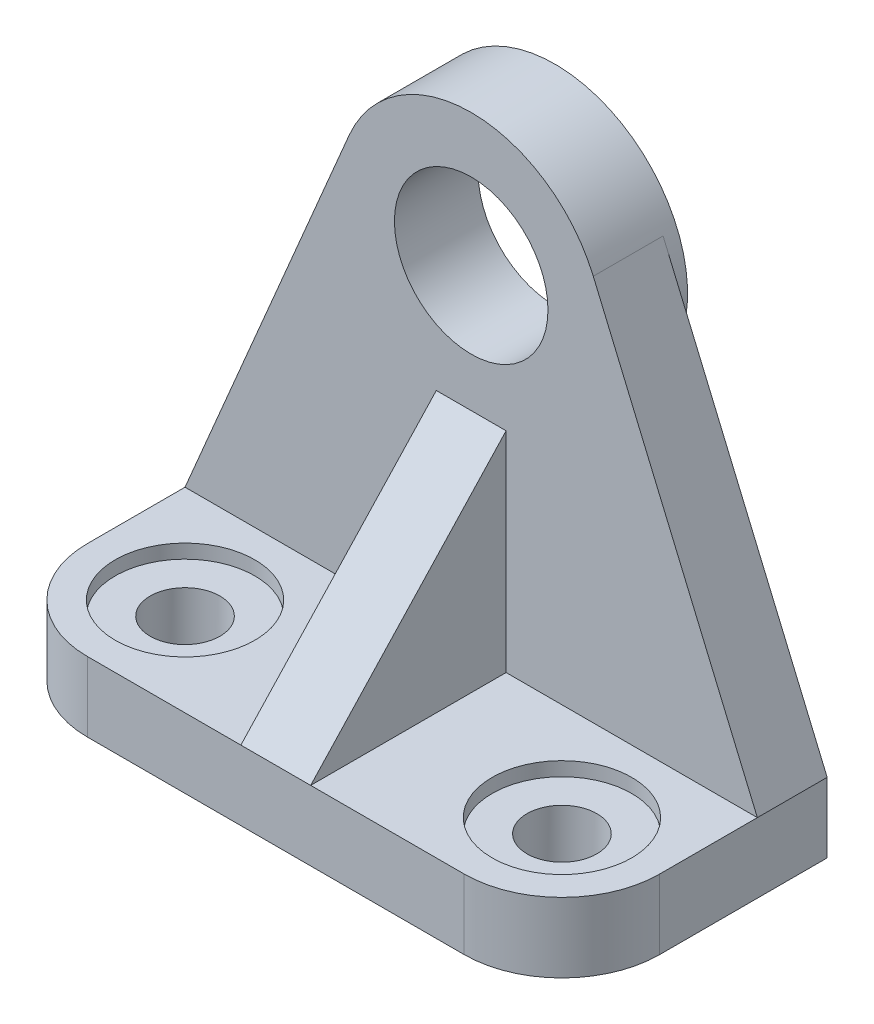
ISO-10303-21;
HEADER;
FILE_DESCRIPTION(('STEP AP214'),'2;1');
FILE_NAME('part.step','',(''),(''),'','','');
FILE_SCHEMA(('AUTOMOTIVE_DESIGN { 1 0 10303 214 1 1 1 1 }'));
ENDSEC;
DATA;
#1=APPLICATION_CONTEXT('core data for automotive mechanical design processes');
#2=APPLICATION_PROTOCOL_DEFINITION('international standard','automotive_design',2000,#1);
#3=PRODUCT_CONTEXT('',#1,'mechanical');
#4=PRODUCT('Part','Part','',(#3));
#5=PRODUCT_RELATED_PRODUCT_CATEGORY('part','',(#4));
#6=PRODUCT_DEFINITION_FORMATION('','',#4);
#7=PRODUCT_DEFINITION_CONTEXT('part definition',#1,'design');
#8=PRODUCT_DEFINITION('design','',#6,#7);
#9=PRODUCT_DEFINITION_SHAPE('','',#8);
#10=(LENGTH_UNIT() NAMED_UNIT(*) SI_UNIT(.MILLI.,.METRE.));
#11=(NAMED_UNIT(*) PLANE_ANGLE_UNIT() SI_UNIT($,.RADIAN.));
#12=(NAMED_UNIT(*) SI_UNIT($,.STERADIAN.) SOLID_ANGLE_UNIT());
#13=UNCERTAINTY_MEASURE_WITH_UNIT(LENGTH_MEASURE(1.E-05),#10,'distance_accuracy_value','');
#14=(GEOMETRIC_REPRESENTATION_CONTEXT(3) GLOBAL_UNCERTAINTY_ASSIGNED_CONTEXT((#13)) GLOBAL_UNIT_ASSIGNED_CONTEXT((#10,
#11,#12)) REPRESENTATION_CONTEXT('',''));
#15=CARTESIAN_POINT('',(0.,0.,0.));
#16=DIRECTION('',(0.,0.,1.));
#17=DIRECTION('',(1.,0.,0.));
#18=AXIS2_PLACEMENT_3D('',#15,#16,#17);
#19=CARTESIAN_POINT('',(0.,10.,0.));
#20=DIRECTION('',(0.,0.,1.));
#21=DIRECTION('',(1.,0.,0.));
#22=AXIS2_PLACEMENT_3D('',#19,#20,#21);
#23=PLANE('',#22);
#24=CARTESIAN_POINT('',(0.,58.,0.));
#25=DIRECTION('',(0.,0.,-1.));
#26=DIRECTION('',(-1.,0.,0.));
#27=AXIS2_PLACEMENT_3D('',#24,#25,#26);
#28=CIRCLE('',#27,19.);
#29=CARTESIAN_POINT('',(17.4913668780755,65.4197092083561,0.));
#30=VERTEX_POINT('',#29);
#31=CARTESIAN_POINT('',(-17.4913668780755,65.4197092083561,0.));
#32=VERTEX_POINT('',#31);
#33=EDGE_CURVE('E202',#30,#32,#28,.T.);
#34=ORIENTED_EDGE('',*,*,#33,.F.);
#35=DIRECTION('',(0.390511010966112,-0.920598256740814,0.));
#36=VECTOR('',#35,1.);
#37=CARTESIAN_POINT('',(38.3425847222182,16.2646424901311,0.));
#38=LINE('',#37,#36);
#39=CARTESIAN_POINT('',(41.,10.,0.));
#40=VERTEX_POINT('',#39);
#41=EDGE_CURVE('E152',#30,#40,#38,.T.);
#42=ORIENTED_EDGE('',*,*,#41,.T.);
#43=DIRECTION('',(0.,-1.,0.));
#44=VECTOR('',#43,1.);
#45=CARTESIAN_POINT('',(41.,10.,0.));
#46=LINE('',#45,#44);
#47=CARTESIAN_POINT('',(41.,0.,0.));
#48=VERTEX_POINT('',#47);
#49=EDGE_CURVE('E179',#40,#48,#46,.T.);
#50=ORIENTED_EDGE('',*,*,#49,.T.);
#51=DIRECTION('',(-1.,0.,0.));
#52=VECTOR('',#51,1.);
#53=CARTESIAN_POINT('',(0.,0.,0.));
#54=LINE('',#53,#52);
#55=CARTESIAN_POINT('',(-41.,0.,0.));
#56=VERTEX_POINT('',#55);
#57=EDGE_CURVE('E229',#48,#56,#54,.T.);
#58=ORIENTED_EDGE('',*,*,#57,.T.);
#59=DIRECTION('',(0.,-1.,0.));
#60=VECTOR('',#59,1.);
#61=CARTESIAN_POINT('',(-41.,10.,0.));
#62=LINE('',#61,#60);
#63=CARTESIAN_POINT('',(-41.,10.,0.));
#64=VERTEX_POINT('',#63);
#65=EDGE_CURVE('E238',#64,#56,#62,.T.);
#66=ORIENTED_EDGE('',*,*,#65,.F.);
#67=DIRECTION('',(-0.390511010966112,-0.920598256740814,0.));
#68=VECTOR('',#67,1.);
#69=CARTESIAN_POINT('',(-38.3425847222182,16.2646424901311,0.));
#70=LINE('',#69,#68);
#71=EDGE_CURVE('E210',#32,#64,#70,.T.);
#72=ORIENTED_EDGE('',*,*,#71,.F.);
#73=EDGE_LOOP('',(#34,#42,#50,#58,#66,#72));
#74=FACE_BOUND('',#73,.T.);
#75=ADVANCED_FACE('F41',(#74),#23,.F.);
#76=CARTESIAN_POINT('',(-41.,10.,0.));
#77=DIRECTION('',(1.,0.,0.));
#78=DIRECTION('',(0.,0.,-1.));
#79=AXIS2_PLACEMENT_3D('',#76,#77,#78);
#80=PLANE('',#79);
#81=DIRECTION('',(0.,0.,1.));
#82=VECTOR('',#81,1.);
#83=CARTESIAN_POINT('',(-41.,0.,0.));
#84=LINE('',#83,#82);
#85=CARTESIAN_POINT('',(-41.,0.,24.));
#86=VERTEX_POINT('',#85);
#87=EDGE_CURVE('E240',#56,#86,#84,.T.);
#88=ORIENTED_EDGE('',*,*,#87,.T.);
#89=DIRECTION('',(0.,-1.,0.));
#90=VECTOR('',#89,1.);
#91=CARTESIAN_POINT('',(-41.,10.,24.));
#92=LINE('',#91,#90);
#93=CARTESIAN_POINT('',(-41.,10.,24.));
#94=VERTEX_POINT('',#93);
#95=EDGE_CURVE('E49',#86,#94,#92,.F.);
#96=ORIENTED_EDGE('',*,*,#95,.T.);
#97=DIRECTION('',(0.,0.,1.));
#98=VECTOR('',#97,1.);
#99=CARTESIAN_POINT('',(-41.,10.,0.));
#100=LINE('',#99,#98);
#101=CARTESIAN_POINT('',(-41.,10.,10.));
#102=VERTEX_POINT('',#101);
#103=EDGE_CURVE('E236',#102,#94,#100,.T.);
#104=ORIENTED_EDGE('',*,*,#103,.F.);
#105=EDGE_CURVE('E232',#64,#102,#100,.T.);
#106=ORIENTED_EDGE('',*,*,#105,.F.);
#107=ORIENTED_EDGE('',*,*,#65,.T.);
#108=EDGE_LOOP('',(#88,#96,#104,#106,#107));
#109=FACE_BOUND('',#108,.T.);
#110=ADVANCED_FACE('F256',(#109),#80,.F.);
#111=CARTESIAN_POINT('',(0.,10.,38.));
#112=DIRECTION('',(0.,0.,-1.));
#113=DIRECTION('',(-1.,0.,0.));
#114=AXIS2_PLACEMENT_3D('',#111,#112,#113);
#115=PLANE('',#114);
#116=DIRECTION('',(1.,0.,0.));
#117=VECTOR('',#116,1.);
#118=CARTESIAN_POINT('',(0.,10.,38.));
#119=LINE('',#118,#117);
#120=CARTESIAN_POINT('',(-27.,10.,38.));
#121=VERTEX_POINT('',#120);
#122=CARTESIAN_POINT('',(-5.,10.,38.));
#123=VERTEX_POINT('',#122);
#124=EDGE_CURVE('E235',#121,#123,#119,.T.);
#125=ORIENTED_EDGE('',*,*,#124,.F.);
#126=DIRECTION('',(0.,-1.,0.));
#127=VECTOR('',#126,1.);
#128=CARTESIAN_POINT('',(-27.,10.,38.));
#129=LINE('',#128,#127);
#130=CARTESIAN_POINT('',(-27.,0.,38.));
#131=VERTEX_POINT('',#130);
#132=EDGE_CURVE('E247',#121,#131,#129,.T.);
#133=ORIENTED_EDGE('',*,*,#132,.T.);
#134=DIRECTION('',(1.,0.,0.));
#135=VECTOR('',#134,1.);
#136=CARTESIAN_POINT('',(0.,0.,38.));
#137=LINE('',#136,#135);
#138=CARTESIAN_POINT('',(27.,0.,38.));
#139=VERTEX_POINT('',#138);
#140=EDGE_CURVE('E243',#131,#139,#137,.T.);
#141=ORIENTED_EDGE('',*,*,#140,.T.);
#142=DIRECTION('',(0.,-1.,0.));
#143=VECTOR('',#142,1.);
#144=CARTESIAN_POINT('',(27.,10.,38.));
#145=LINE('',#144,#143);
#146=CARTESIAN_POINT('',(27.,10.,38.));
#147=VERTEX_POINT('',#146);
#148=EDGE_CURVE('E184',#147,#139,#145,.T.);
#149=ORIENTED_EDGE('',*,*,#148,.F.);
#150=DIRECTION('',(-1.,0.,0.));
#151=VECTOR('',#150,1.);
#152=CARTESIAN_POINT('',(0.,10.,38.));
#153=LINE('',#152,#151);
#154=CARTESIAN_POINT('',(5.,10.,38.));
#155=VERTEX_POINT('',#154);
#156=EDGE_CURVE('E176',#147,#155,#153,.T.);
#157=ORIENTED_EDGE('',*,*,#156,.T.);
#158=DIRECTION('',(1.,0.,0.));
#159=VECTOR('',#158,1.);
#160=CARTESIAN_POINT('',(-5.,10.,38.));
#161=LINE('',#160,#159);
#162=EDGE_CURVE('E56',#123,#155,#161,.T.);
#163=ORIENTED_EDGE('',*,*,#162,.F.);
#164=EDGE_LOOP('',(#125,#133,#141,#149,#157,#163));
#165=FACE_BOUND('',#164,.T.);
#166=ADVANCED_FACE('F263',(#165),#115,.F.);
#167=CARTESIAN_POINT('',(0.,10.,0.));
#168=DIRECTION('',(0.,-1.,0.));
#169=DIRECTION('',(0.,0.,-1.));
#170=AXIS2_PLACEMENT_3D('',#167,#168,#169);
#171=PLANE('',#170);
#172=CARTESIAN_POINT('',(-27.,10.,24.));
#173=DIRECTION('',(0.,1.,0.));
#174=DIRECTION('',(0.,0.,1.));
#175=AXIS2_PLACEMENT_3D('',#172,#173,#174);
#176=CIRCLE('',#175,10.);
#177=CARTESIAN_POINT('',(-27.,10.,34.));
#178=VERTEX_POINT('',#177);
#179=EDGE_CURVE('E223',#178,#178,#176,.T.);
#180=ORIENTED_EDGE('',*,*,#179,.F.);
#181=EDGE_LOOP('',(#180));
#182=FACE_BOUND('',#181,.T.);
#183=ORIENTED_EDGE('',*,*,#124,.T.);
#184=DIRECTION('',(0.,0.,-1.));
#185=VECTOR('',#184,1.);
#186=CARTESIAN_POINT('',(-5.,10.,10.));
#187=LINE('',#186,#185);
#188=CARTESIAN_POINT('',(-5.,10.,10.));
#189=VERTEX_POINT('',#188);
#190=EDGE_CURVE('E198',#123,#189,#187,.T.);
#191=ORIENTED_EDGE('',*,*,#190,.T.);
#192=DIRECTION('',(-1.,0.,0.));
#193=VECTOR('',#192,1.);
#194=CARTESIAN_POINT('',(0.,10.,10.));
#195=LINE('',#194,#193);
#196=EDGE_CURVE('E215',#189,#102,#195,.T.);
#197=ORIENTED_EDGE('',*,*,#196,.T.);
#198=ORIENTED_EDGE('',*,*,#103,.T.);
#199=CARTESIAN_POINT('',(-27.,10.,24.));
#200=DIRECTION('',(0.,-1.,0.));
#201=DIRECTION('',(0.,0.,-1.));
#202=AXIS2_PLACEMENT_3D('',#199,#200,#201);
#203=CIRCLE('',#202,14.);
#204=EDGE_CURVE('E11',#94,#121,#203,.F.);
#205=ORIENTED_EDGE('',*,*,#204,.T.);
#206=EDGE_LOOP('',(#183,#191,#197,#198,#205));
#207=FACE_BOUND('',#206,.T.);
#208=ADVANCED_FACE('F262',(#182,#207),#171,.F.);
#209=CARTESIAN_POINT('',(0.,0.,0.));
#210=DIRECTION('',(0.,-1.,0.));
#211=DIRECTION('',(0.,0.,-1.));
#212=AXIS2_PLACEMENT_3D('',#209,#210,#211);
#213=PLANE('',#212);
#214=CARTESIAN_POINT('',(-27.,0.,24.));
#215=DIRECTION('',(0.,-1.,0.));
#216=DIRECTION('',(0.,0.,-1.));
#217=AXIS2_PLACEMENT_3D('',#214,#215,#216);
#218=CIRCLE('',#217,5.);
#219=CARTESIAN_POINT('',(-27.,0.,19.));
#220=VERTEX_POINT('',#219);
#221=EDGE_CURVE('E219',#220,#220,#218,.F.);
#222=ORIENTED_EDGE('',*,*,#221,.T.);
#223=EDGE_LOOP('',(#222));
#224=FACE_BOUND('',#223,.T.);
#225=ORIENTED_EDGE('',*,*,#140,.F.);
#226=CARTESIAN_POINT('',(-27.,0.,24.));
#227=DIRECTION('',(0.,-1.,0.));
#228=DIRECTION('',(0.,0.,-1.));
#229=AXIS2_PLACEMENT_3D('',#226,#227,#228);
#230=CIRCLE('',#229,14.);
#231=EDGE_CURVE('E250',#131,#86,#230,.T.);
#232=ORIENTED_EDGE('',*,*,#231,.T.);
#233=ORIENTED_EDGE('',*,*,#87,.F.);
#234=ORIENTED_EDGE('',*,*,#57,.F.);
#235=DIRECTION('',(0.,0.,1.));
#236=VECTOR('',#235,1.);
#237=CARTESIAN_POINT('',(41.,0.,0.));
#238=LINE('',#237,#236);
#239=CARTESIAN_POINT('',(41.,0.,24.));
#240=VERTEX_POINT('',#239);
#241=EDGE_CURVE('E170',#48,#240,#238,.T.);
#242=ORIENTED_EDGE('',*,*,#241,.T.);
#243=CARTESIAN_POINT('',(27.,0.,24.));
#244=DIRECTION('',(0.,1.,0.));
#245=DIRECTION('',(0.,0.,-1.));
#246=AXIS2_PLACEMENT_3D('',#243,#244,#245);
#247=CIRCLE('',#246,14.);
#248=EDGE_CURVE('E187',#139,#240,#247,.T.);
#249=ORIENTED_EDGE('',*,*,#248,.F.);
#250=EDGE_LOOP('',(#225,#232,#233,#234,#242,#249));
#251=FACE_BOUND('',#250,.T.);
#252=CARTESIAN_POINT('',(27.,0.,24.));
#253=DIRECTION('',(0.,1.,0.));
#254=DIRECTION('',(0.,0.,-1.));
#255=AXIS2_PLACEMENT_3D('',#252,#253,#254);
#256=CIRCLE('',#255,5.);
#257=CARTESIAN_POINT('',(27.,0.,19.));
#258=VERTEX_POINT('',#257);
#259=EDGE_CURVE('E156',#258,#258,#256,.F.);
#260=ORIENTED_EDGE('',*,*,#259,.F.);
#261=EDGE_LOOP('',(#260));
#262=FACE_BOUND('',#261,.T.);
#263=ADVANCED_FACE('F268',(#224,#251,#262),#213,.T.);
#264=CARTESIAN_POINT('',(-27.,8.,24.));
#265=DIRECTION('',(0.,1.,0.));
#266=DIRECTION('',(0.,0.,1.));
#267=AXIS2_PLACEMENT_3D('',#264,#265,#266);
#268=CYLINDRICAL_SURFACE('',#267,10.);
#269=CARTESIAN_POINT('',(-27.,8.,24.));
#270=DIRECTION('',(0.,1.,0.));
#271=DIRECTION('',(0.,0.,1.));
#272=AXIS2_PLACEMENT_3D('',#269,#270,#271);
#273=CIRCLE('',#272,10.);
#274=CARTESIAN_POINT('',(-27.,8.,34.));
#275=VERTEX_POINT('',#274);
#276=EDGE_CURVE('E226',#275,#275,#273,.T.);
#277=ORIENTED_EDGE('',*,*,#276,.F.);
#278=EDGE_LOOP('',(#277));
#279=FACE_BOUND('',#278,.T.);
#280=ORIENTED_EDGE('',*,*,#179,.T.);
#281=EDGE_LOOP('',(#280));
#282=FACE_BOUND('',#281,.T.);
#283=ADVANCED_FACE('F316',(#279,#282),#268,.F.);
#284=CARTESIAN_POINT('',(-27.,8.,24.));
#285=DIRECTION('',(0.,1.,0.));
#286=DIRECTION('',(0.,0.,1.));
#287=AXIS2_PLACEMENT_3D('',#284,#285,#286);
#288=PLANE('',#287);
#289=CARTESIAN_POINT('',(-27.,8.,24.));
#290=DIRECTION('',(0.,1.,0.));
#291=DIRECTION('',(0.,0.,1.));
#292=AXIS2_PLACEMENT_3D('',#289,#290,#291);
#293=CIRCLE('',#292,5.);
#294=CARTESIAN_POINT('',(-27.,8.,29.));
#295=VERTEX_POINT('',#294);
#296=EDGE_CURVE('E220',#295,#295,#293,.F.);
#297=ORIENTED_EDGE('',*,*,#296,.T.);
#298=EDGE_LOOP('',(#297));
#299=FACE_BOUND('',#298,.T.);
#300=ORIENTED_EDGE('',*,*,#276,.T.);
#301=EDGE_LOOP('',(#300));
#302=FACE_BOUND('',#301,.T.);
#303=ADVANCED_FACE('F323',(#299,#302),#288,.T.);
#304=CARTESIAN_POINT('',(-27.,-0.000999999999999265,24.));
#305=DIRECTION('',(0.,1.,0.));
#306=DIRECTION('',(0.,0.,1.));
#307=AXIS2_PLACEMENT_3D('',#304,#305,#306);
#308=CYLINDRICAL_SURFACE('',#307,5.);
#309=ORIENTED_EDGE('',*,*,#221,.F.);
#310=EDGE_LOOP('',(#309));
#311=FACE_BOUND('',#310,.T.);
#312=ORIENTED_EDGE('',*,*,#296,.F.);
#313=EDGE_LOOP('',(#312));
#314=FACE_BOUND('',#313,.T.);
#315=ADVANCED_FACE('F327',(#311,#314),#308,.F.);
#316=CARTESIAN_POINT('',(-27.,10.,24.));
#317=DIRECTION('',(0.,-1.,0.));
#318=DIRECTION('',(0.,0.,-1.));
#319=AXIS2_PLACEMENT_3D('',#316,#317,#318);
#320=CYLINDRICAL_SURFACE('',#319,14.);
#321=ORIENTED_EDGE('',*,*,#204,.F.);
#322=ORIENTED_EDGE('',*,*,#95,.F.);
#323=ORIENTED_EDGE('',*,*,#231,.F.);
#324=ORIENTED_EDGE('',*,*,#132,.F.);
#325=EDGE_LOOP('',(#321,#322,#323,#324));
#326=FACE_BOUND('',#325,.T.);
#327=ADVANCED_FACE('F43',(#326),#320,.T.);
#328=CARTESIAN_POINT('',(0.,58.,10.));
#329=DIRECTION('',(0.,0.,-1.));
#330=DIRECTION('',(-1.,0.,0.));
#331=AXIS2_PLACEMENT_3D('',#328,#329,#330);
#332=CYLINDRICAL_SURFACE('',#331,11.);
#333=CARTESIAN_POINT('',(0.,58.,-2.));
#334=DIRECTION('',(0.,0.,-1.));
#335=DIRECTION('',(-1.,0.,0.));
#336=AXIS2_PLACEMENT_3D('',#333,#334,#335);
#337=CIRCLE('',#336,11.);
#338=CARTESIAN_POINT('',(-11.,58.,-2.));
#339=VERTEX_POINT('',#338);
#340=EDGE_CURVE('E207',#339,#339,#337,.F.);
#341=ORIENTED_EDGE('',*,*,#340,.F.);
#342=EDGE_LOOP('',(#341));
#343=FACE_BOUND('',#342,.T.);
#344=CARTESIAN_POINT('',(0.,58.,10.));
#345=DIRECTION('',(0.,0.,1.));
#346=DIRECTION('',(1.,0.,0.));
#347=AXIS2_PLACEMENT_3D('',#344,#345,#346);
#348=CIRCLE('',#347,11.);
#349=CARTESIAN_POINT('',(11.,58.,10.));
#350=VERTEX_POINT('',#349);
#351=EDGE_CURVE('E143',#350,#350,#348,.T.);
#352=ORIENTED_EDGE('',*,*,#351,.T.);
#353=EDGE_LOOP('',(#352));
#354=FACE_BOUND('',#353,.T.);
#355=ADVANCED_FACE('F332',(#343,#354),#332,.F.);
#356=CARTESIAN_POINT('',(0.,58.,10.));
#357=DIRECTION('',(0.,0.,-1.));
#358=DIRECTION('',(-1.,0.,0.));
#359=AXIS2_PLACEMENT_3D('',#356,#357,#358);
#360=CYLINDRICAL_SURFACE('',#359,19.);
#361=DIRECTION('',(0.,0.,-1.));
#362=VECTOR('',#361,1.);
#363=CARTESIAN_POINT('',(17.4913668780755,65.4197092083561,10.));
#364=LINE('',#363,#362);
#365=CARTESIAN_POINT('',(17.4913668780755,65.4197092083561,10.));
#366=VERTEX_POINT('',#365);
#367=EDGE_CURVE('E136',#366,#30,#364,.T.);
#368=ORIENTED_EDGE('',*,*,#367,.T.);
#369=ORIENTED_EDGE('',*,*,#33,.T.);
#370=DIRECTION('',(0.,0.,-1.));
#371=VECTOR('',#370,1.);
#372=CARTESIAN_POINT('',(-17.4913668780755,65.4197092083561,10.));
#373=LINE('',#372,#371);
#374=CARTESIAN_POINT('',(-17.4913668780755,65.4197092083561,10.));
#375=VERTEX_POINT('',#374);
#376=EDGE_CURVE('E139',#375,#32,#373,.T.);
#377=ORIENTED_EDGE('',*,*,#376,.F.);
#378=CARTESIAN_POINT('',(0.,58.,10.));
#379=DIRECTION('',(0.,0.,1.));
#380=DIRECTION('',(1.,0.,0.));
#381=AXIS2_PLACEMENT_3D('',#378,#379,#380);
#382=CIRCLE('',#381,19.);
#383=EDGE_CURVE('E131',#366,#375,#382,.T.);
#384=ORIENTED_EDGE('',*,*,#383,.F.);
#385=EDGE_LOOP('',(#368,#369,#377,#384));
#386=FACE_BOUND('',#385,.T.);
#387=CARTESIAN_POINT('',(0.,58.,-2.));
#388=DIRECTION('',(0.,0.,-1.));
#389=DIRECTION('',(-1.,0.,0.));
#390=AXIS2_PLACEMENT_3D('',#387,#388,#389);
#391=CIRCLE('',#390,19.);
#392=CARTESIAN_POINT('',(-19.,58.,-2.));
#393=VERTEX_POINT('',#392);
#394=EDGE_CURVE('E204',#393,#393,#391,.T.);
#395=ORIENTED_EDGE('',*,*,#394,.F.);
#396=EDGE_LOOP('',(#395));
#397=FACE_BOUND('',#396,.T.);
#398=ADVANCED_FACE('F133',(#386,#397),#360,.T.);
#399=CARTESIAN_POINT('',(-38.3425847222182,16.2646424901311,10.));
#400=DIRECTION('',(0.920598256740814,-0.390511010966112,0.));
#401=DIRECTION('',(0.390511010966112,0.920598256740814,0.));
#402=AXIS2_PLACEMENT_3D('',#399,#400,#401);
#403=PLANE('',#402);
#404=ORIENTED_EDGE('',*,*,#71,.T.);
#405=ORIENTED_EDGE('',*,*,#105,.T.);
#406=DIRECTION('',(-0.390511010966112,-0.920598256740814,0.));
#407=VECTOR('',#406,1.);
#408=CARTESIAN_POINT('',(-38.3425847222182,16.2646424901311,10.));
#409=LINE('',#408,#407);
#410=EDGE_CURVE('E142',#375,#102,#409,.T.);
#411=ORIENTED_EDGE('',*,*,#410,.F.);
#412=ORIENTED_EDGE('',*,*,#376,.T.);
#413=EDGE_LOOP('',(#404,#405,#411,#412));
#414=FACE_BOUND('',#413,.T.);
#415=ADVANCED_FACE('F297',(#414),#403,.F.);
#416=CARTESIAN_POINT('',(0.,0.,10.));
#417=DIRECTION('',(0.,0.,1.));
#418=DIRECTION('',(1.,0.,0.));
#419=AXIS2_PLACEMENT_3D('',#416,#417,#418);
#420=PLANE('',#419);
#421=ORIENTED_EDGE('',*,*,#351,.F.);
#422=EDGE_LOOP('',(#421));
#423=FACE_BOUND('',#422,.T.);
#424=DIRECTION('',(1.,0.,0.));
#425=VECTOR('',#424,1.);
#426=CARTESIAN_POINT('',(-5.,40.,10.));
#427=LINE('',#426,#425);
#428=CARTESIAN_POINT('',(-5.,40.,10.));
#429=VERTEX_POINT('',#428);
#430=CARTESIAN_POINT('',(5.,40.,10.));
#431=VERTEX_POINT('',#430);
#432=EDGE_CURVE('E200',#429,#431,#427,.T.);
#433=ORIENTED_EDGE('',*,*,#432,.T.);
#434=DIRECTION('',(0.,1.,0.));
#435=VECTOR('',#434,1.);
#436=CARTESIAN_POINT('',(5.,40.,10.));
#437=LINE('',#436,#435);
#438=CARTESIAN_POINT('',(5.,10.,10.));
#439=VERTEX_POINT('',#438);
#440=EDGE_CURVE('E285',#439,#431,#437,.T.);
#441=ORIENTED_EDGE('',*,*,#440,.F.);
#442=DIRECTION('',(1.,0.,0.));
#443=VECTOR('',#442,1.);
#444=CARTESIAN_POINT('',(0.,10.,10.));
#445=LINE('',#444,#443);
#446=CARTESIAN_POINT('',(41.,10.,10.));
#447=VERTEX_POINT('',#446);
#448=EDGE_CURVE('E149',#439,#447,#445,.T.);
#449=ORIENTED_EDGE('',*,*,#448,.T.);
#450=DIRECTION('',(0.390511010966112,-0.920598256740814,0.));
#451=VECTOR('',#450,1.);
#452=CARTESIAN_POINT('',(38.3425847222182,16.2646424901311,10.));
#453=LINE('',#452,#451);
#454=EDGE_CURVE('E146',#366,#447,#453,.T.);
#455=ORIENTED_EDGE('',*,*,#454,.F.);
#456=ORIENTED_EDGE('',*,*,#383,.T.);
#457=ORIENTED_EDGE('',*,*,#410,.T.);
#458=ORIENTED_EDGE('',*,*,#196,.F.);
#459=DIRECTION('',(0.,1.,0.));
#460=VECTOR('',#459,1.);
#461=CARTESIAN_POINT('',(-5.,40.,10.));
#462=LINE('',#461,#460);
#463=EDGE_CURVE('E64',#189,#429,#462,.T.);
#464=ORIENTED_EDGE('',*,*,#463,.T.);
#465=EDGE_LOOP('',(#433,#441,#449,#455,#456,#457,#458,#464));
#466=FACE_BOUND('',#465,.T.);
#467=ADVANCED_FACE('F147',(#423,#466),#420,.T.);
#468=CARTESIAN_POINT('',(0.,0.,-2.));
#469=DIRECTION('',(0.,0.,-1.));
#470=DIRECTION('',(-1.,0.,0.));
#471=AXIS2_PLACEMENT_3D('',#468,#469,#470);
#472=PLANE('',#471);
#473=ORIENTED_EDGE('',*,*,#394,.T.);
#474=EDGE_LOOP('',(#473));
#475=FACE_BOUND('',#474,.T.);
#476=ORIENTED_EDGE('',*,*,#340,.T.);
#477=EDGE_LOOP('',(#476));
#478=FACE_BOUND('',#477,.T.);
#479=ADVANCED_FACE('F342',(#475,#478),#472,.T.);
#480=CARTESIAN_POINT('',(-5.,10.,38.));
#481=DIRECTION('',(0.,0.682318250360011,0.731055268242869));
#482=DIRECTION('',(0.,-0.731055268242869,0.682318250360011));
#483=AXIS2_PLACEMENT_3D('',#480,#481,#482);
#484=PLANE('',#483);
#485=ORIENTED_EDGE('',*,*,#162,.T.);
#486=DIRECTION('',(0.,-0.731055268242869,0.682318250360011));
#487=VECTOR('',#486,1.);
#488=CARTESIAN_POINT('',(5.,10.,38.));
#489=LINE('',#488,#487);
#490=EDGE_CURVE('E283',#431,#155,#489,.T.);
#491=ORIENTED_EDGE('',*,*,#490,.F.);
#492=ORIENTED_EDGE('',*,*,#432,.F.);
#493=DIRECTION('',(0.,-0.731055268242869,0.682318250360011));
#494=VECTOR('',#493,1.);
#495=CARTESIAN_POINT('',(-5.,10.,38.));
#496=LINE('',#495,#494);
#497=EDGE_CURVE('E195',#429,#123,#496,.T.);
#498=ORIENTED_EDGE('',*,*,#497,.T.);
#499=EDGE_LOOP('',(#485,#491,#492,#498));
#500=FACE_BOUND('',#499,.T.);
#501=ADVANCED_FACE('F292',(#500),#484,.T.);
#502=CARTESIAN_POINT('',(-5.,0.,0.));
#503=DIRECTION('',(-1.,0.,0.));
#504=DIRECTION('',(0.,0.,1.));
#505=AXIS2_PLACEMENT_3D('',#502,#503,#504);
#506=PLANE('',#505);
#507=ORIENTED_EDGE('',*,*,#463,.F.);
#508=ORIENTED_EDGE('',*,*,#190,.F.);
#509=ORIENTED_EDGE('',*,*,#497,.F.);
#510=EDGE_LOOP('',(#507,#508,#509));
#511=FACE_BOUND('',#510,.T.);
#512=ADVANCED_FACE('F295',(#511),#506,.T.);
#513=CARTESIAN_POINT('',(41.,10.,0.));
#514=DIRECTION('',(-1.,0.,0.));
#515=DIRECTION('',(0.,0.,-1.));
#516=AXIS2_PLACEMENT_3D('',#513,#514,#515);
#517=PLANE('',#516);
#518=ORIENTED_EDGE('',*,*,#241,.F.);
#519=ORIENTED_EDGE('',*,*,#49,.F.);
#520=DIRECTION('',(0.,0.,1.));
#521=VECTOR('',#520,1.);
#522=CARTESIAN_POINT('',(41.,10.,0.));
#523=LINE('',#522,#521);
#524=EDGE_CURVE('E173',#40,#447,#523,.T.);
#525=ORIENTED_EDGE('',*,*,#524,.T.);
#526=CARTESIAN_POINT('',(41.,10.,24.));
#527=VERTEX_POINT('',#526);
#528=EDGE_CURVE('E177',#447,#527,#523,.T.);
#529=ORIENTED_EDGE('',*,*,#528,.T.);
#530=DIRECTION('',(0.,-1.,0.));
#531=VECTOR('',#530,1.);
#532=CARTESIAN_POINT('',(41.,10.,24.));
#533=LINE('',#532,#531);
#534=EDGE_CURVE('E189',#240,#527,#533,.F.);
#535=ORIENTED_EDGE('',*,*,#534,.F.);
#536=EDGE_LOOP('',(#518,#519,#525,#529,#535));
#537=FACE_BOUND('',#536,.T.);
#538=ADVANCED_FACE('F303',(#537),#517,.F.);
#539=CARTESIAN_POINT('',(0.,10.,0.));
#540=DIRECTION('',(0.,-1.,0.));
#541=DIRECTION('',(0.,0.,-1.));
#542=AXIS2_PLACEMENT_3D('',#539,#540,#541);
#543=PLANE('',#542);
#544=CARTESIAN_POINT('',(27.,10.,24.));
#545=DIRECTION('',(0.,-1.,0.));
#546=DIRECTION('',(0.,0.,1.));
#547=AXIS2_PLACEMENT_3D('',#544,#545,#546);
#548=CIRCLE('',#547,10.);
#549=CARTESIAN_POINT('',(27.,10.,34.));
#550=VERTEX_POINT('',#549);
#551=EDGE_CURVE('E165',#550,#550,#548,.T.);
#552=ORIENTED_EDGE('',*,*,#551,.T.);
#553=EDGE_LOOP('',(#552));
#554=FACE_BOUND('',#553,.T.);
#555=ORIENTED_EDGE('',*,*,#156,.F.);
#556=CARTESIAN_POINT('',(27.,10.,24.));
#557=DIRECTION('',(0.,1.,0.));
#558=DIRECTION('',(0.,0.,-1.));
#559=AXIS2_PLACEMENT_3D('',#556,#557,#558);
#560=CIRCLE('',#559,14.);
#561=EDGE_CURVE('E192',#527,#147,#560,.F.);
#562=ORIENTED_EDGE('',*,*,#561,.F.);
#563=ORIENTED_EDGE('',*,*,#528,.F.);
#564=ORIENTED_EDGE('',*,*,#448,.F.);
#565=DIRECTION('',(0.,0.,-1.));
#566=VECTOR('',#565,1.);
#567=CARTESIAN_POINT('',(5.,10.,10.));
#568=LINE('',#567,#566);
#569=EDGE_CURVE('E279',#155,#439,#568,.T.);
#570=ORIENTED_EDGE('',*,*,#569,.F.);
#571=EDGE_LOOP('',(#555,#562,#563,#564,#570));
#572=FACE_BOUND('',#571,.T.);
#573=ADVANCED_FACE('F277',(#554,#572),#543,.F.);
#574=CARTESIAN_POINT('',(27.,8.,24.));
#575=DIRECTION('',(0.,1.,0.));
#576=DIRECTION('',(0.,0.,1.));
#577=AXIS2_PLACEMENT_3D('',#574,#575,#576);
#578=CYLINDRICAL_SURFACE('',#577,10.);
#579=CARTESIAN_POINT('',(27.,8.,24.));
#580=DIRECTION('',(0.,-1.,0.));
#581=DIRECTION('',(0.,0.,1.));
#582=AXIS2_PLACEMENT_3D('',#579,#580,#581);
#583=CIRCLE('',#582,10.);
#584=CARTESIAN_POINT('',(27.,8.,34.));
#585=VERTEX_POINT('',#584);
#586=EDGE_CURVE('E167',#585,#585,#583,.T.);
#587=ORIENTED_EDGE('',*,*,#586,.T.);
#588=EDGE_LOOP('',(#587));
#589=FACE_BOUND('',#588,.T.);
#590=ORIENTED_EDGE('',*,*,#551,.F.);
#591=EDGE_LOOP('',(#590));
#592=FACE_BOUND('',#591,.T.);
#593=ADVANCED_FACE('F358',(#589,#592),#578,.F.);
#594=CARTESIAN_POINT('',(27.,8.,24.));
#595=DIRECTION('',(0.,1.,0.));
#596=DIRECTION('',(0.,0.,1.));
#597=AXIS2_PLACEMENT_3D('',#594,#595,#596);
#598=PLANE('',#597);
#599=CARTESIAN_POINT('',(27.,8.,24.));
#600=DIRECTION('',(0.,-1.,0.));
#601=DIRECTION('',(0.,0.,1.));
#602=AXIS2_PLACEMENT_3D('',#599,#600,#601);
#603=CIRCLE('',#602,5.);
#604=CARTESIAN_POINT('',(27.,8.,29.));
#605=VERTEX_POINT('',#604);
#606=EDGE_CURVE('E159',#605,#605,#603,.F.);
#607=ORIENTED_EDGE('',*,*,#606,.F.);
#608=EDGE_LOOP('',(#607));
#609=FACE_BOUND('',#608,.T.);
#610=ORIENTED_EDGE('',*,*,#586,.F.);
#611=EDGE_LOOP('',(#610));
#612=FACE_BOUND('',#611,.T.);
#613=ADVANCED_FACE('F362',(#609,#612),#598,.T.);
#614=CARTESIAN_POINT('',(27.,-0.000999999999999265,24.));
#615=DIRECTION('',(0.,1.,0.));
#616=DIRECTION('',(0.,0.,1.));
#617=AXIS2_PLACEMENT_3D('',#614,#615,#616);
#618=CYLINDRICAL_SURFACE('',#617,5.);
#619=ORIENTED_EDGE('',*,*,#259,.T.);
#620=EDGE_LOOP('',(#619));
#621=FACE_BOUND('',#620,.T.);
#622=ORIENTED_EDGE('',*,*,#606,.T.);
#623=EDGE_LOOP('',(#622));
#624=FACE_BOUND('',#623,.T.);
#625=ADVANCED_FACE('F353',(#621,#624),#618,.F.);
#626=CARTESIAN_POINT('',(27.,10.,24.));
#627=DIRECTION('',(0.,-1.,0.));
#628=DIRECTION('',(0.,0.,-1.));
#629=AXIS2_PLACEMENT_3D('',#626,#627,#628);
#630=CYLINDRICAL_SURFACE('',#629,14.);
#631=ORIENTED_EDGE('',*,*,#561,.T.);
#632=ORIENTED_EDGE('',*,*,#148,.T.);
#633=ORIENTED_EDGE('',*,*,#248,.T.);
#634=ORIENTED_EDGE('',*,*,#534,.T.);
#635=EDGE_LOOP('',(#631,#632,#633,#634));
#636=FACE_BOUND('',#635,.T.);
#637=ADVANCED_FACE('F273',(#636),#630,.T.);
#638=CARTESIAN_POINT('',(38.3425847222182,16.2646424901311,10.));
#639=DIRECTION('',(-0.920598256740814,-0.390511010966112,0.));
#640=DIRECTION('',(-0.390511010966112,0.920598256740814,0.));
#641=AXIS2_PLACEMENT_3D('',#638,#639,#640);
#642=PLANE('',#641);
#643=ORIENTED_EDGE('',*,*,#41,.F.);
#644=ORIENTED_EDGE('',*,*,#367,.F.);
#645=ORIENTED_EDGE('',*,*,#454,.T.);
#646=ORIENTED_EDGE('',*,*,#524,.F.);
#647=EDGE_LOOP('',(#643,#644,#645,#646));
#648=FACE_BOUND('',#647,.T.);
#649=ADVANCED_FACE('F154',(#648),#642,.F.);
#650=CARTESIAN_POINT('',(5.,0.,0.));
#651=DIRECTION('',(1.,0.,0.));
#652=DIRECTION('',(0.,0.,1.));
#653=AXIS2_PLACEMENT_3D('',#650,#651,#652);
#654=PLANE('',#653);
#655=ORIENTED_EDGE('',*,*,#440,.T.);
#656=ORIENTED_EDGE('',*,*,#490,.T.);
#657=ORIENTED_EDGE('',*,*,#569,.T.);
#658=EDGE_LOOP('',(#655,#656,#657));
#659=FACE_BOUND('',#658,.T.);
#660=ADVANCED_FACE('F288',(#659),#654,.T.);
#661=CLOSED_SHELL('',(#75,#110,#166,#208,#263,#283,#303,#315,#327,#355,#398,#415,#467,#479,#501,
#512,#538,#573,#593,#613,#625,#637,#649,#660));
#662=MANIFOLD_SOLID_BREP('B2',#661);
#663=ADVANCED_BREP_SHAPE_REPRESENTATION('',(#18,#662),#14);
#664=SHAPE_DEFINITION_REPRESENTATION(#9,#663);
ENDSEC;
END-ISO-10303-21;
